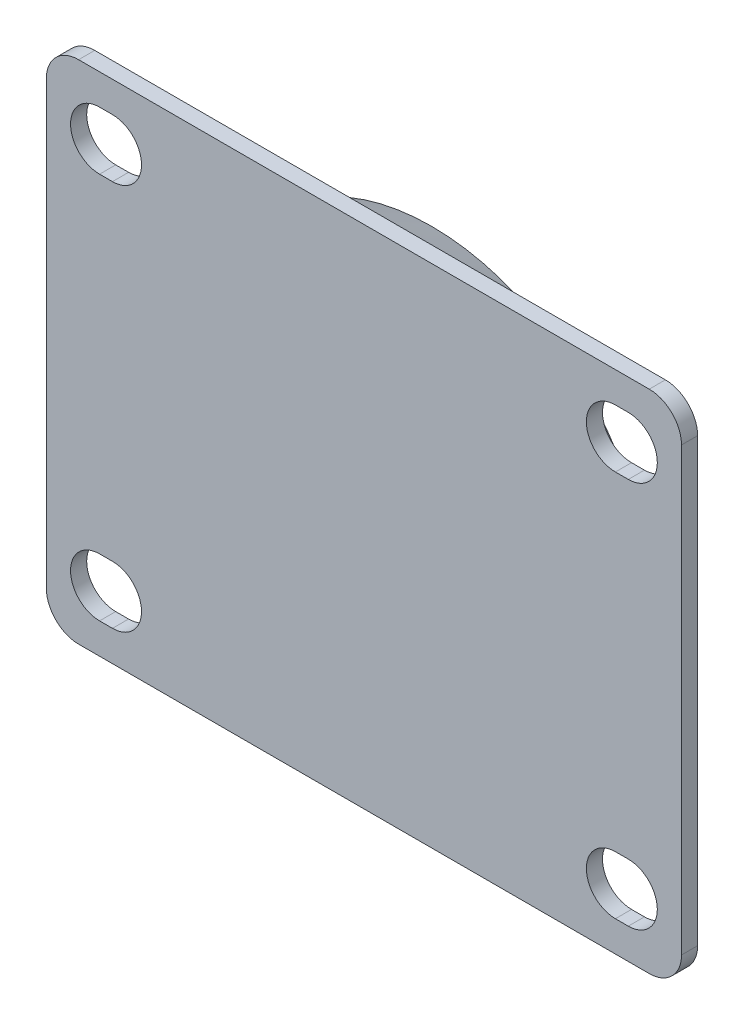
ISO-10303-21;
HEADER;
FILE_DESCRIPTION(('STEP AP214'),'2;1');
FILE_NAME('part.step','',(''),(''),'','','');
FILE_SCHEMA(('AUTOMOTIVE_DESIGN { 1 0 10303 214 1 1 1 1 }'));
ENDSEC;
DATA;
#1=APPLICATION_CONTEXT('core data for automotive mechanical design processes');
#2=APPLICATION_PROTOCOL_DEFINITION('international standard','automotive_design',2000,#1);
#3=PRODUCT_CONTEXT('',#1,'mechanical');
#4=PRODUCT('Part','Part','',(#3));
#5=PRODUCT_RELATED_PRODUCT_CATEGORY('part','',(#4));
#6=PRODUCT_DEFINITION_FORMATION('','',#4);
#7=PRODUCT_DEFINITION_CONTEXT('part definition',#1,'design');
#8=PRODUCT_DEFINITION('design','',#6,#7);
#9=PRODUCT_DEFINITION_SHAPE('','',#8);
#10=(LENGTH_UNIT() NAMED_UNIT(*) SI_UNIT(.MILLI.,.METRE.));
#11=(NAMED_UNIT(*) PLANE_ANGLE_UNIT() SI_UNIT($,.RADIAN.));
#12=(NAMED_UNIT(*) SI_UNIT($,.STERADIAN.) SOLID_ANGLE_UNIT());
#13=UNCERTAINTY_MEASURE_WITH_UNIT(LENGTH_MEASURE(1.E-05),#10,'distance_accuracy_value','');
#14=(GEOMETRIC_REPRESENTATION_CONTEXT(3) GLOBAL_UNCERTAINTY_ASSIGNED_CONTEXT((#13)) GLOBAL_UNIT_ASSIGNED_CONTEXT((#10,
#11,#12)) REPRESENTATION_CONTEXT('',''));
#15=CARTESIAN_POINT('',(0.,0.,0.));
#16=DIRECTION('',(0.,0.,1.));
#17=DIRECTION('',(1.,0.,0.));
#18=AXIS2_PLACEMENT_3D('',#15,#16,#17);
#19=CARTESIAN_POINT('',(-44.25,34.25,0.));
#20=DIRECTION('',(0.,0.,1.));
#21=DIRECTION('',(1.,0.,0.));
#22=AXIS2_PLACEMENT_3D('',#19,#20,#21);
#23=PLANE('',#22);
#24=CARTESIAN_POINT('',(0.,0.,0.));
#25=DIRECTION('',(0.,0.,1.));
#26=DIRECTION('',(1.,0.,0.));
#27=AXIS2_PLACEMENT_3D('',#24,#25,#26);
#28=CIRCLE('',#27,33.75);
#29=CARTESIAN_POINT('',(33.75,0.,0.));
#30=VERTEX_POINT('',#29);
#31=EDGE_CURVE('E290',#30,#30,#28,.F.);
#32=ORIENTED_EDGE('',*,*,#31,.T.);
#33=EDGE_LOOP('',(#32));
#34=FACE_BOUND('',#33,.T.);
#35=ADVANCED_FACE('F17',(#34),#23,.F.);
#36=CARTESIAN_POINT('',(0.,0.,0.));
#37=DIRECTION('',(0.,0.,1.));
#38=DIRECTION('',(1.,0.,0.));
#39=AXIS2_PLACEMENT_3D('',#36,#37,#38);
#40=CYLINDRICAL_SURFACE('',#39,33.75);
#41=CARTESIAN_POINT('',(0.,0.,-8.00000000000001));
#42=DIRECTION('',(0.,0.,1.));
#43=DIRECTION('',(1.,0.,0.));
#44=AXIS2_PLACEMENT_3D('',#41,#42,#43);
#45=CIRCLE('',#44,33.75);
#46=CARTESIAN_POINT('',(33.75,0.,-8.));
#47=VERTEX_POINT('',#46);
#48=EDGE_CURVE('E292',#47,#47,#45,.T.);
#49=ORIENTED_EDGE('',*,*,#48,.F.);
#50=EDGE_LOOP('',(#49));
#51=FACE_BOUND('',#50,.T.);
#52=ORIENTED_EDGE('',*,*,#31,.F.);
#53=EDGE_LOOP('',(#52));
#54=FACE_BOUND('',#53,.T.);
#55=ADVANCED_FACE('F701',(#51,#54),#40,.F.);
#56=CARTESIAN_POINT('',(0.,0.,-1.10557280900008));
#57=DIRECTION('',(0.,0.,1.));
#58=DIRECTION('',(1.,0.,0.));
#59=AXIS2_PLACEMENT_3D('',#56,#57,#58);
#60=CONICAL_SURFACE('',#59,37.1972135955,0.463647609000806);
#61=CARTESIAN_POINT('',(0.,0.,-1.10557280900009));
#62=DIRECTION('',(0.,0.,1.));
#63=DIRECTION('',(1.,0.,0.));
#64=AXIS2_PLACEMENT_3D('',#61,#62,#63);
#65=CIRCLE('',#64,37.1972135955);
#66=CARTESIAN_POINT('',(37.1972135955,0.,-1.10557280900009));
#67=VERTEX_POINT('',#66);
#68=EDGE_CURVE('E203',#67,#67,#65,.F.);
#69=ORIENTED_EDGE('',*,*,#68,.T.);
#70=EDGE_LOOP('',(#69));
#71=FACE_BOUND('',#70,.T.);
#72=ORIENTED_EDGE('',*,*,#48,.T.);
#73=EDGE_LOOP('',(#72));
#74=FACE_BOUND('',#73,.T.);
#75=ADVANCED_FACE('F694',(#71,#74),#60,.T.);
#76=CARTESIAN_POINT('',(0.,0.,-2.));
#77=DIRECTION('',(0.,0.,1.));
#78=DIRECTION('',(1.,0.,0.));
#79=AXIS2_PLACEMENT_3D('',#76,#77,#78);
#80=TOROIDAL_SURFACE('',#79,38.9860679774998,2.);
#81=CARTESIAN_POINT('',(0.,0.,0.));
#82=DIRECTION('',(0.,0.,-1.));
#83=DIRECTION('',(-1.,0.,0.));
#84=AXIS2_PLACEMENT_3D('',#81,#82,#83);
#85=CIRCLE('',#84,38.9860679774998);
#86=CARTESIAN_POINT('',(-38.9860679774998,0.,0.));
#87=VERTEX_POINT('',#86);
#88=CARTESIAN_POINT('',(38.9860679774998,0.,0.));
#89=VERTEX_POINT('',#88);
#90=EDGE_CURVE('E193',#87,#89,#85,.T.);
#91=ORIENTED_EDGE('',*,*,#90,.T.);
#92=CARTESIAN_POINT('',(0.,0.,0.));
#93=DIRECTION('',(0.,0.,-1.));
#94=DIRECTION('',(1.,0.,0.));
#95=AXIS2_PLACEMENT_3D('',#92,#93,#94);
#96=CIRCLE('',#95,38.9860679774998);
#97=EDGE_CURVE('E191',#89,#87,#96,.T.);
#98=ORIENTED_EDGE('',*,*,#97,.T.);
#99=EDGE_LOOP('',(#91,#98));
#100=FACE_BOUND('',#99,.T.);
#101=ORIENTED_EDGE('',*,*,#68,.F.);
#102=EDGE_LOOP('',(#101));
#103=FACE_BOUND('',#102,.T.);
#104=ADVANCED_FACE('F195',(#100,#103),#80,.F.);
#105=CARTESIAN_POINT('',(-44.25,34.25,0.));
#106=DIRECTION('',(0.,0.,1.));
#107=DIRECTION('',(1.,0.,0.));
#108=AXIS2_PLACEMENT_3D('',#105,#106,#107);
#109=PLANE('',#108);
#110=DIRECTION('',(1.,0.,0.));
#111=VECTOR('',#110,1.);
#112=CARTESIAN_POINT('',(41.,-25.5,0.));
#113=LINE('',#112,#111);
#114=CARTESIAN_POINT('',(39.,-25.5,0.));
#115=VERTEX_POINT('',#114);
#116=CARTESIAN_POINT('',(41.,-25.5,0.));
#117=VERTEX_POINT('',#116);
#118=EDGE_CURVE('E184',#115,#117,#113,.T.);
#119=ORIENTED_EDGE('',*,*,#118,.F.);
#120=CARTESIAN_POINT('',(39.,-30.,0.));
#121=DIRECTION('',(0.,0.,-1.));
#122=DIRECTION('',(-1.,0.,0.));
#123=AXIS2_PLACEMENT_3D('',#120,#121,#122);
#124=CIRCLE('',#123,4.5);
#125=CARTESIAN_POINT('',(39.,-34.5,0.));
#126=VERTEX_POINT('',#125);
#127=EDGE_CURVE('E272',#115,#126,#124,.F.);
#128=ORIENTED_EDGE('',*,*,#127,.T.);
#129=DIRECTION('',(-1.,0.,0.));
#130=VECTOR('',#129,1.);
#131=CARTESIAN_POINT('',(39.,-34.5,0.));
#132=LINE('',#131,#130);
#133=CARTESIAN_POINT('',(41.,-34.5,0.));
#134=VERTEX_POINT('',#133);
#135=EDGE_CURVE('E178',#134,#126,#132,.T.);
#136=ORIENTED_EDGE('',*,*,#135,.F.);
#137=CARTESIAN_POINT('',(41.,-30.,0.));
#138=DIRECTION('',(0.,0.,-1.));
#139=DIRECTION('',(-1.,0.,0.));
#140=AXIS2_PLACEMENT_3D('',#137,#138,#139);
#141=CIRCLE('',#140,4.5);
#142=EDGE_CURVE('E279',#134,#117,#141,.F.);
#143=ORIENTED_EDGE('',*,*,#142,.T.);
#144=EDGE_LOOP('',(#119,#128,#136,#143));
#145=FACE_BOUND('',#144,.T.);
#146=CARTESIAN_POINT('',(-41.,30.,0.));
#147=DIRECTION('',(0.,0.,-1.));
#148=DIRECTION('',(-1.,0.,0.));
#149=AXIS2_PLACEMENT_3D('',#146,#147,#148);
#150=CIRCLE('',#149,4.5);
#151=CARTESIAN_POINT('',(-41.,34.5,0.));
#152=VERTEX_POINT('',#151);
#153=CARTESIAN_POINT('',(-41.,25.5,0.));
#154=VERTEX_POINT('',#153);
#155=EDGE_CURVE('E276',#152,#154,#150,.F.);
#156=ORIENTED_EDGE('',*,*,#155,.T.);
#157=DIRECTION('',(-1.,0.,0.));
#158=VECTOR('',#157,1.);
#159=CARTESIAN_POINT('',(-41.,25.5,0.));
#160=LINE('',#159,#158);
#161=CARTESIAN_POINT('',(-39.,25.5,0.));
#162=VERTEX_POINT('',#161);
#163=EDGE_CURVE('E268',#162,#154,#160,.T.);
#164=ORIENTED_EDGE('',*,*,#163,.F.);
#165=CARTESIAN_POINT('',(-39.,30.,0.));
#166=DIRECTION('',(0.,0.,-1.));
#167=DIRECTION('',(-1.,0.,0.));
#168=AXIS2_PLACEMENT_3D('',#165,#166,#167);
#169=CIRCLE('',#168,4.5);
#170=CARTESIAN_POINT('',(-39.,34.5,0.));
#171=VERTEX_POINT('',#170);
#172=EDGE_CURVE('E360',#162,#171,#169,.F.);
#173=ORIENTED_EDGE('',*,*,#172,.T.);
#174=DIRECTION('',(1.,0.,0.));
#175=VECTOR('',#174,1.);
#176=CARTESIAN_POINT('',(-39.,34.5,0.));
#177=LINE('',#176,#175);
#178=EDGE_CURVE('E273',#152,#171,#177,.T.);
#179=ORIENTED_EDGE('',*,*,#178,.F.);
#180=EDGE_LOOP('',(#156,#164,#173,#179));
#181=FACE_BOUND('',#180,.T.);
#182=DIRECTION('',(1.,0.,0.));
#183=VECTOR('',#182,1.);
#184=CARTESIAN_POINT('',(-44.25,39.25,0.));
#185=LINE('',#184,#183);
#186=CARTESIAN_POINT('',(-44.25,39.25,0.));
#187=VERTEX_POINT('',#186);
#188=CARTESIAN_POINT('',(44.25,39.25,0.));
#189=VERTEX_POINT('',#188);
#190=EDGE_CURVE('E245',#187,#189,#185,.T.);
#191=ORIENTED_EDGE('',*,*,#190,.T.);
#192=CARTESIAN_POINT('',(44.25,34.25,0.));
#193=DIRECTION('',(0.,0.,-1.));
#194=DIRECTION('',(-1.,0.,0.));
#195=AXIS2_PLACEMENT_3D('',#192,#193,#194);
#196=CIRCLE('',#195,5.);
#197=CARTESIAN_POINT('',(49.25,34.25,0.));
#198=VERTEX_POINT('',#197);
#199=EDGE_CURVE('E256',#198,#189,#196,.F.);
#200=ORIENTED_EDGE('',*,*,#199,.F.);
#201=DIRECTION('',(0.,-1.,0.));
#202=VECTOR('',#201,1.);
#203=CARTESIAN_POINT('',(49.25,-34.25,0.));
#204=LINE('',#203,#202);
#205=CARTESIAN_POINT('',(49.25,-34.25,0.));
#206=VERTEX_POINT('',#205);
#207=EDGE_CURVE('E253',#198,#206,#204,.T.);
#208=ORIENTED_EDGE('',*,*,#207,.T.);
#209=CARTESIAN_POINT('',(44.25,-34.25,0.));
#210=DIRECTION('',(0.,0.,-1.));
#211=DIRECTION('',(-1.,0.,0.));
#212=AXIS2_PLACEMENT_3D('',#209,#210,#211);
#213=CIRCLE('',#212,5.);
#214=CARTESIAN_POINT('',(44.25,-39.25,0.));
#215=VERTEX_POINT('',#214);
#216=EDGE_CURVE('E261',#215,#206,#213,.F.);
#217=ORIENTED_EDGE('',*,*,#216,.F.);
#218=DIRECTION('',(1.,0.,0.));
#219=VECTOR('',#218,1.);
#220=CARTESIAN_POINT('',(-44.25,-39.25,0.));
#221=LINE('',#220,#219);
#222=CARTESIAN_POINT('',(-44.25,-39.25,0.));
#223=VERTEX_POINT('',#222);
#224=EDGE_CURVE('E258',#215,#223,#221,.F.);
#225=ORIENTED_EDGE('',*,*,#224,.T.);
#226=CARTESIAN_POINT('',(-44.25,-34.25,0.));
#227=DIRECTION('',(0.,0.,-1.));
#228=DIRECTION('',(-1.,0.,0.));
#229=AXIS2_PLACEMENT_3D('',#226,#227,#228);
#230=CIRCLE('',#229,5.);
#231=CARTESIAN_POINT('',(-49.25,-34.25,0.));
#232=VERTEX_POINT('',#231);
#233=EDGE_CURVE('E266',#232,#223,#230,.F.);
#234=ORIENTED_EDGE('',*,*,#233,.F.);
#235=DIRECTION('',(0.,1.,0.));
#236=VECTOR('',#235,1.);
#237=CARTESIAN_POINT('',(-49.25,-34.25,0.));
#238=LINE('',#237,#236);
#239=CARTESIAN_POINT('',(-49.25,34.25,0.));
#240=VERTEX_POINT('',#239);
#241=EDGE_CURVE('E263',#232,#240,#238,.T.);
#242=ORIENTED_EDGE('',*,*,#241,.T.);
#243=CARTESIAN_POINT('',(-44.25,34.25,0.));
#244=DIRECTION('',(0.,0.,-1.));
#245=DIRECTION('',(-1.,0.,0.));
#246=AXIS2_PLACEMENT_3D('',#243,#244,#245);
#247=CIRCLE('',#246,5.);
#248=EDGE_CURVE('E358',#187,#240,#247,.F.);
#249=ORIENTED_EDGE('',*,*,#248,.F.);
#250=EDGE_LOOP('',(#191,#200,#208,#217,#225,#234,#242,#249));
#251=FACE_BOUND('',#250,.T.);
#252=CARTESIAN_POINT('',(39.,30.,0.));
#253=DIRECTION('',(0.,0.,-1.));
#254=DIRECTION('',(-1.,0.,0.));
#255=AXIS2_PLACEMENT_3D('',#252,#253,#254);
#256=CIRCLE('',#255,4.5);
#257=CARTESIAN_POINT('',(39.,34.5,0.));
#258=VERTEX_POINT('',#257);
#259=CARTESIAN_POINT('',(39.,25.5,0.));
#260=VERTEX_POINT('',#259);
#261=EDGE_CURVE('E249',#258,#260,#256,.F.);
#262=ORIENTED_EDGE('',*,*,#261,.T.);
#263=DIRECTION('',(-1.,0.,0.));
#264=VECTOR('',#263,1.);
#265=CARTESIAN_POINT('',(41.,25.5,0.));
#266=LINE('',#265,#264);
#267=CARTESIAN_POINT('',(41.,25.5,0.));
#268=VERTEX_POINT('',#267);
#269=EDGE_CURVE('E241',#268,#260,#266,.T.);
#270=ORIENTED_EDGE('',*,*,#269,.F.);
#271=CARTESIAN_POINT('',(41.,30.,0.));
#272=DIRECTION('',(0.,0.,-1.));
#273=DIRECTION('',(-1.,0.,0.));
#274=AXIS2_PLACEMENT_3D('',#271,#272,#273);
#275=CIRCLE('',#274,4.5);
#276=CARTESIAN_POINT('',(41.,34.5,0.));
#277=VERTEX_POINT('',#276);
#278=EDGE_CURVE('E236',#268,#277,#275,.F.);
#279=ORIENTED_EDGE('',*,*,#278,.T.);
#280=DIRECTION('',(1.,0.,0.));
#281=VECTOR('',#280,1.);
#282=CARTESIAN_POINT('',(39.,34.5,0.));
#283=LINE('',#282,#281);
#284=EDGE_CURVE('E246',#258,#277,#283,.T.);
#285=ORIENTED_EDGE('',*,*,#284,.F.);
#286=EDGE_LOOP('',(#262,#270,#279,#285));
#287=FACE_BOUND('',#286,.T.);
#288=DIRECTION('',(1.,0.,0.));
#289=VECTOR('',#288,1.);
#290=CARTESIAN_POINT('',(-41.,-25.5,0.));
#291=LINE('',#290,#289);
#292=CARTESIAN_POINT('',(-41.,-25.5,0.));
#293=VERTEX_POINT('',#292);
#294=CARTESIAN_POINT('',(-39.,-25.5,0.));
#295=VERTEX_POINT('',#294);
#296=EDGE_CURVE('E228',#293,#295,#291,.T.);
#297=ORIENTED_EDGE('',*,*,#296,.F.);
#298=CARTESIAN_POINT('',(-41.,-30.,0.));
#299=DIRECTION('',(0.,0.,-1.));
#300=DIRECTION('',(-1.,0.,0.));
#301=AXIS2_PLACEMENT_3D('',#298,#299,#300);
#302=CIRCLE('',#301,4.5);
#303=CARTESIAN_POINT('',(-41.,-34.5,0.));
#304=VERTEX_POINT('',#303);
#305=EDGE_CURVE('E343',#293,#304,#302,.F.);
#306=ORIENTED_EDGE('',*,*,#305,.T.);
#307=DIRECTION('',(-1.,0.,0.));
#308=VECTOR('',#307,1.);
#309=CARTESIAN_POINT('',(-39.,-34.5,0.));
#310=LINE('',#309,#308);
#311=CARTESIAN_POINT('',(-39.,-34.5,0.));
#312=VERTEX_POINT('',#311);
#313=EDGE_CURVE('E237',#312,#304,#310,.T.);
#314=ORIENTED_EDGE('',*,*,#313,.F.);
#315=CARTESIAN_POINT('',(-39.,-30.,0.));
#316=DIRECTION('',(0.,0.,-1.));
#317=DIRECTION('',(-1.,0.,0.));
#318=AXIS2_PLACEMENT_3D('',#315,#316,#317);
#319=CIRCLE('',#318,4.5);
#320=EDGE_CURVE('E240',#312,#295,#319,.F.);
#321=ORIENTED_EDGE('',*,*,#320,.T.);
#322=EDGE_LOOP('',(#297,#306,#314,#321));
#323=FACE_BOUND('',#322,.T.);
#324=ORIENTED_EDGE('',*,*,#97,.F.);
#325=ORIENTED_EDGE('',*,*,#90,.F.);
#326=EDGE_LOOP('',(#324,#325));
#327=FACE_BOUND('',#326,.T.);
#328=ADVANCED_FACE('F202',(#145,#181,#251,#287,#323,#327),#109,.F.);
#329=CARTESIAN_POINT('',(41.,-25.5,2.5));
#330=DIRECTION('',(0.,-1.,0.));
#331=DIRECTION('',(1.,0.,0.));
#332=AXIS2_PLACEMENT_3D('',#329,#330,#331);
#333=PLANE('',#332);
#334=DIRECTION('',(1.,0.,0.));
#335=VECTOR('',#334,1.);
#336=CARTESIAN_POINT('',(-44.25,-25.5,2.5));
#337=LINE('',#336,#335);
#338=CARTESIAN_POINT('',(39.,-25.5,2.5));
#339=VERTEX_POINT('',#338);
#340=CARTESIAN_POINT('',(41.,-25.5,2.5));
#341=VERTEX_POINT('',#340);
#342=EDGE_CURVE('E342',#339,#341,#337,.T.);
#343=ORIENTED_EDGE('',*,*,#342,.F.);
#344=DIRECTION('',(0.,0.,-1.));
#345=VECTOR('',#344,1.);
#346=CARTESIAN_POINT('',(39.,-25.5,2.5));
#347=LINE('',#346,#345);
#348=EDGE_CURVE('E372',#339,#115,#347,.T.);
#349=ORIENTED_EDGE('',*,*,#348,.T.);
#350=ORIENTED_EDGE('',*,*,#118,.T.);
#351=DIRECTION('',(0.,0.,-1.));
#352=VECTOR('',#351,1.);
#353=CARTESIAN_POINT('',(41.,-25.5,2.5));
#354=LINE('',#353,#352);
#355=EDGE_CURVE('E206',#117,#341,#354,.F.);
#356=ORIENTED_EDGE('',*,*,#355,.T.);
#357=EDGE_LOOP('',(#343,#349,#350,#356));
#358=FACE_BOUND('',#357,.T.);
#359=ADVANCED_FACE('F220',(#358),#333,.T.);
#360=CARTESIAN_POINT('',(41.,-30.,2.5));
#361=DIRECTION('',(0.,0.,-1.));
#362=DIRECTION('',(-1.,0.,0.));
#363=AXIS2_PLACEMENT_3D('',#360,#361,#362);
#364=CYLINDRICAL_SURFACE('',#363,4.5);
#365=DIRECTION('',(0.,0.,1.));
#366=VECTOR('',#365,1.);
#367=CARTESIAN_POINT('',(41.,-34.5,2.5));
#368=LINE('',#367,#366);
#369=CARTESIAN_POINT('',(41.,-34.5,2.5));
#370=VERTEX_POINT('',#369);
#371=EDGE_CURVE('E278',#370,#134,#368,.F.);
#372=ORIENTED_EDGE('',*,*,#371,.F.);
#373=CARTESIAN_POINT('',(41.,-30.,2.5));
#374=DIRECTION('',(0.,0.,-1.));
#375=DIRECTION('',(-1.,0.,0.));
#376=AXIS2_PLACEMENT_3D('',#373,#374,#375);
#377=CIRCLE('',#376,4.5);
#378=EDGE_CURVE('E339',#341,#370,#377,.T.);
#379=ORIENTED_EDGE('',*,*,#378,.F.);
#380=ORIENTED_EDGE('',*,*,#355,.F.);
#381=ORIENTED_EDGE('',*,*,#142,.F.);
#382=EDGE_LOOP('',(#372,#379,#380,#381));
#383=FACE_BOUND('',#382,.T.);
#384=ADVANCED_FACE('F667',(#383),#364,.F.);
#385=CARTESIAN_POINT('',(39.,-34.5,2.5));
#386=DIRECTION('',(0.,1.,0.));
#387=DIRECTION('',(-1.,0.,0.));
#388=AXIS2_PLACEMENT_3D('',#385,#386,#387);
#389=PLANE('',#388);
#390=DIRECTION('',(1.,0.,0.));
#391=VECTOR('',#390,1.);
#392=CARTESIAN_POINT('',(-44.25,-34.5,2.5));
#393=LINE('',#392,#391);
#394=CARTESIAN_POINT('',(39.,-34.5,2.5));
#395=VERTEX_POINT('',#394);
#396=EDGE_CURVE('E338',#370,#395,#393,.F.);
#397=ORIENTED_EDGE('',*,*,#396,.F.);
#398=ORIENTED_EDGE('',*,*,#371,.T.);
#399=ORIENTED_EDGE('',*,*,#135,.T.);
#400=DIRECTION('',(0.,0.,-1.));
#401=VECTOR('',#400,1.);
#402=CARTESIAN_POINT('',(39.,-34.5,2.5));
#403=LINE('',#402,#401);
#404=EDGE_CURVE('E284',#126,#395,#403,.F.);
#405=ORIENTED_EDGE('',*,*,#404,.T.);
#406=EDGE_LOOP('',(#397,#398,#399,#405));
#407=FACE_BOUND('',#406,.T.);
#408=ADVANCED_FACE('F376',(#407),#389,.T.);
#409=CARTESIAN_POINT('',(39.,-30.,2.5));
#410=DIRECTION('',(0.,0.,-1.));
#411=DIRECTION('',(-1.,0.,0.));
#412=AXIS2_PLACEMENT_3D('',#409,#410,#411);
#413=CYLINDRICAL_SURFACE('',#412,4.5);
#414=ORIENTED_EDGE('',*,*,#348,.F.);
#415=CARTESIAN_POINT('',(39.,-30.,2.5));
#416=DIRECTION('',(0.,0.,-1.));
#417=DIRECTION('',(-1.,0.,0.));
#418=AXIS2_PLACEMENT_3D('',#415,#416,#417);
#419=CIRCLE('',#418,4.5);
#420=EDGE_CURVE('E336',#395,#339,#419,.T.);
#421=ORIENTED_EDGE('',*,*,#420,.F.);
#422=ORIENTED_EDGE('',*,*,#404,.F.);
#423=ORIENTED_EDGE('',*,*,#127,.F.);
#424=EDGE_LOOP('',(#414,#421,#422,#423));
#425=FACE_BOUND('',#424,.T.);
#426=ADVANCED_FACE('F381',(#425),#413,.F.);
#427=CARTESIAN_POINT('',(-41.,25.5,2.5));
#428=DIRECTION('',(0.,1.,0.));
#429=DIRECTION('',(-1.,0.,0.));
#430=AXIS2_PLACEMENT_3D('',#427,#428,#429);
#431=PLANE('',#430);
#432=DIRECTION('',(1.,0.,0.));
#433=VECTOR('',#432,1.);
#434=CARTESIAN_POINT('',(-44.25,25.5,2.5));
#435=LINE('',#434,#433);
#436=CARTESIAN_POINT('',(-39.,25.5,2.5));
#437=VERTEX_POINT('',#436);
#438=CARTESIAN_POINT('',(-41.,25.5,2.5));
#439=VERTEX_POINT('',#438);
#440=EDGE_CURVE('E335',#437,#439,#435,.F.);
#441=ORIENTED_EDGE('',*,*,#440,.F.);
#442=DIRECTION('',(0.,0.,-1.));
#443=VECTOR('',#442,1.);
#444=CARTESIAN_POINT('',(-39.,25.5,2.5));
#445=LINE('',#444,#443);
#446=EDGE_CURVE('E362',#437,#162,#445,.T.);
#447=ORIENTED_EDGE('',*,*,#446,.T.);
#448=ORIENTED_EDGE('',*,*,#163,.T.);
#449=DIRECTION('',(0.,0.,-1.));
#450=VECTOR('',#449,1.);
#451=CARTESIAN_POINT('',(-41.,25.5,2.5));
#452=LINE('',#451,#450);
#453=EDGE_CURVE('E271',#154,#439,#452,.F.);
#454=ORIENTED_EDGE('',*,*,#453,.T.);
#455=EDGE_LOOP('',(#441,#447,#448,#454));
#456=FACE_BOUND('',#455,.T.);
#457=ADVANCED_FACE('F422',(#456),#431,.T.);
#458=CARTESIAN_POINT('',(-41.,30.,2.5));
#459=DIRECTION('',(0.,0.,-1.));
#460=DIRECTION('',(-1.,0.,0.));
#461=AXIS2_PLACEMENT_3D('',#458,#459,#460);
#462=CYLINDRICAL_SURFACE('',#461,4.5);
#463=DIRECTION('',(0.,0.,1.));
#464=VECTOR('',#463,1.);
#465=CARTESIAN_POINT('',(-41.,34.5,2.5));
#466=LINE('',#465,#464);
#467=CARTESIAN_POINT('',(-41.,34.5,2.5));
#468=VERTEX_POINT('',#467);
#469=EDGE_CURVE('E275',#468,#152,#466,.F.);
#470=ORIENTED_EDGE('',*,*,#469,.F.);
#471=CARTESIAN_POINT('',(-41.,30.,2.5));
#472=DIRECTION('',(0.,0.,-1.));
#473=DIRECTION('',(-1.,0.,0.));
#474=AXIS2_PLACEMENT_3D('',#471,#472,#473);
#475=CIRCLE('',#474,4.5);
#476=EDGE_CURVE('E333',#439,#468,#475,.T.);
#477=ORIENTED_EDGE('',*,*,#476,.F.);
#478=ORIENTED_EDGE('',*,*,#453,.F.);
#479=ORIENTED_EDGE('',*,*,#155,.F.);
#480=EDGE_LOOP('',(#470,#477,#478,#479));
#481=FACE_BOUND('',#480,.T.);
#482=ADVANCED_FACE('F433',(#481),#462,.F.);
#483=CARTESIAN_POINT('',(-39.,34.5,2.5));
#484=DIRECTION('',(0.,-1.,0.));
#485=DIRECTION('',(1.,0.,0.));
#486=AXIS2_PLACEMENT_3D('',#483,#484,#485);
#487=PLANE('',#486);
#488=DIRECTION('',(1.,0.,0.));
#489=VECTOR('',#488,1.);
#490=CARTESIAN_POINT('',(-44.25,34.5,2.5));
#491=LINE('',#490,#489);
#492=CARTESIAN_POINT('',(-39.,34.5,2.5));
#493=VERTEX_POINT('',#492);
#494=EDGE_CURVE('E332',#468,#493,#491,.T.);
#495=ORIENTED_EDGE('',*,*,#494,.F.);
#496=ORIENTED_EDGE('',*,*,#469,.T.);
#497=ORIENTED_EDGE('',*,*,#178,.T.);
#498=DIRECTION('',(0.,0.,-1.));
#499=VECTOR('',#498,1.);
#500=CARTESIAN_POINT('',(-39.,34.5,2.5));
#501=LINE('',#500,#499);
#502=EDGE_CURVE('E418',#171,#493,#501,.F.);
#503=ORIENTED_EDGE('',*,*,#502,.T.);
#504=EDGE_LOOP('',(#495,#496,#497,#503));
#505=FACE_BOUND('',#504,.T.);
#506=ADVANCED_FACE('F435',(#505),#487,.T.);
#507=CARTESIAN_POINT('',(-39.,30.,2.5));
#508=DIRECTION('',(0.,0.,-1.));
#509=DIRECTION('',(-1.,0.,0.));
#510=AXIS2_PLACEMENT_3D('',#507,#508,#509);
#511=CYLINDRICAL_SURFACE('',#510,4.5);
#512=ORIENTED_EDGE('',*,*,#446,.F.);
#513=CARTESIAN_POINT('',(-39.,30.,2.5));
#514=DIRECTION('',(0.,0.,-1.));
#515=DIRECTION('',(-1.,0.,0.));
#516=AXIS2_PLACEMENT_3D('',#513,#514,#515);
#517=CIRCLE('',#516,4.5);
#518=EDGE_CURVE('E329',#493,#437,#517,.T.);
#519=ORIENTED_EDGE('',*,*,#518,.F.);
#520=ORIENTED_EDGE('',*,*,#502,.F.);
#521=ORIENTED_EDGE('',*,*,#172,.F.);
#522=EDGE_LOOP('',(#512,#519,#520,#521));
#523=FACE_BOUND('',#522,.T.);
#524=ADVANCED_FACE('F427',(#523),#511,.F.);
#525=CARTESIAN_POINT('',(-44.25,34.25,2.5));
#526=DIRECTION('',(0.,0.,-1.));
#527=DIRECTION('',(-1.,0.,0.));
#528=AXIS2_PLACEMENT_3D('',#525,#526,#527);
#529=CYLINDRICAL_SURFACE('',#528,5.);
#530=CARTESIAN_POINT('',(-44.25,34.25,2.5));
#531=DIRECTION('',(0.,0.,-1.));
#532=DIRECTION('',(-1.,0.,0.));
#533=AXIS2_PLACEMENT_3D('',#530,#531,#532);
#534=CIRCLE('',#533,5.);
#535=CARTESIAN_POINT('',(-44.25,39.25,2.5));
#536=VERTEX_POINT('',#535);
#537=CARTESIAN_POINT('',(-49.25,34.25,2.5));
#538=VERTEX_POINT('',#537);
#539=EDGE_CURVE('E326',#536,#538,#534,.F.);
#540=ORIENTED_EDGE('',*,*,#539,.F.);
#541=DIRECTION('',(0.,0.,-1.));
#542=VECTOR('',#541,1.);
#543=CARTESIAN_POINT('',(-44.25,39.25,2.5));
#544=LINE('',#543,#542);
#545=EDGE_CURVE('E252',#536,#187,#544,.T.);
#546=ORIENTED_EDGE('',*,*,#545,.T.);
#547=ORIENTED_EDGE('',*,*,#248,.T.);
#548=DIRECTION('',(0.,0.,1.));
#549=VECTOR('',#548,1.);
#550=CARTESIAN_POINT('',(-49.25,34.25,2.5));
#551=LINE('',#550,#549);
#552=EDGE_CURVE('E267',#240,#538,#551,.T.);
#553=ORIENTED_EDGE('',*,*,#552,.T.);
#554=EDGE_LOOP('',(#540,#546,#547,#553));
#555=FACE_BOUND('',#554,.T.);
#556=ADVANCED_FACE('F615',(#555),#529,.T.);
#557=CARTESIAN_POINT('',(-49.25,-34.25,2.5));
#558=DIRECTION('',(1.,0.,0.));
#559=DIRECTION('',(0.,1.,0.));
#560=AXIS2_PLACEMENT_3D('',#557,#558,#559);
#561=PLANE('',#560);
#562=DIRECTION('',(0.,0.,-1.));
#563=VECTOR('',#562,1.);
#564=CARTESIAN_POINT('',(-49.25,-34.25,2.5));
#565=LINE('',#564,#563);
#566=CARTESIAN_POINT('',(-49.25,-34.25,2.5));
#567=VERTEX_POINT('',#566);
#568=EDGE_CURVE('E357',#567,#232,#565,.T.);
#569=ORIENTED_EDGE('',*,*,#568,.F.);
#570=DIRECTION('',(0.,1.,0.));
#571=VECTOR('',#570,1.);
#572=CARTESIAN_POINT('',(-49.25,34.25,2.5));
#573=LINE('',#572,#571);
#574=EDGE_CURVE('E325',#538,#567,#573,.F.);
#575=ORIENTED_EDGE('',*,*,#574,.F.);
#576=ORIENTED_EDGE('',*,*,#552,.F.);
#577=ORIENTED_EDGE('',*,*,#241,.F.);
#578=EDGE_LOOP('',(#569,#575,#576,#577));
#579=FACE_BOUND('',#578,.T.);
#580=ADVANCED_FACE('F606',(#579),#561,.F.);
#581=CARTESIAN_POINT('',(-44.25,-34.25,2.5));
#582=DIRECTION('',(0.,0.,-1.));
#583=DIRECTION('',(-1.,0.,0.));
#584=AXIS2_PLACEMENT_3D('',#581,#582,#583);
#585=CYLINDRICAL_SURFACE('',#584,5.);
#586=CARTESIAN_POINT('',(-44.25,-34.25,2.5));
#587=DIRECTION('',(0.,0.,-1.));
#588=DIRECTION('',(-1.,0.,0.));
#589=AXIS2_PLACEMENT_3D('',#586,#587,#588);
#590=CIRCLE('',#589,5.);
#591=CARTESIAN_POINT('',(-44.25,-39.25,2.5));
#592=VERTEX_POINT('',#591);
#593=EDGE_CURVE('E322',#567,#592,#590,.F.);
#594=ORIENTED_EDGE('',*,*,#593,.F.);
#595=ORIENTED_EDGE('',*,*,#568,.T.);
#596=ORIENTED_EDGE('',*,*,#233,.T.);
#597=DIRECTION('',(0.,0.,1.));
#598=VECTOR('',#597,1.);
#599=CARTESIAN_POINT('',(-44.25,-39.25,2.5));
#600=LINE('',#599,#598);
#601=EDGE_CURVE('E262',#223,#592,#600,.T.);
#602=ORIENTED_EDGE('',*,*,#601,.T.);
#603=EDGE_LOOP('',(#594,#595,#596,#602));
#604=FACE_BOUND('',#603,.T.);
#605=ADVANCED_FACE('F597',(#604),#585,.T.);
#606=CARTESIAN_POINT('',(-44.25,-39.25,2.5));
#607=DIRECTION('',(0.,1.,0.));
#608=DIRECTION('',(0.,0.,1.));
#609=AXIS2_PLACEMENT_3D('',#606,#607,#608);
#610=PLANE('',#609);
#611=DIRECTION('',(0.,0.,-1.));
#612=VECTOR('',#611,1.);
#613=CARTESIAN_POINT('',(44.25,-39.25,2.5));
#614=LINE('',#613,#612);
#615=CARTESIAN_POINT('',(44.25,-39.25,2.5));
#616=VERTEX_POINT('',#615);
#617=EDGE_CURVE('E355',#616,#215,#614,.T.);
#618=ORIENTED_EDGE('',*,*,#617,.F.);
#619=DIRECTION('',(1.,0.,0.));
#620=VECTOR('',#619,1.);
#621=CARTESIAN_POINT('',(-44.25,-39.25,2.5));
#622=LINE('',#621,#620);
#623=EDGE_CURVE('E321',#592,#616,#622,.T.);
#624=ORIENTED_EDGE('',*,*,#623,.F.);
#625=ORIENTED_EDGE('',*,*,#601,.F.);
#626=ORIENTED_EDGE('',*,*,#224,.F.);
#627=EDGE_LOOP('',(#618,#624,#625,#626));
#628=FACE_BOUND('',#627,.T.);
#629=ADVANCED_FACE('F588',(#628),#610,.F.);
#630=CARTESIAN_POINT('',(44.25,-34.25,2.5));
#631=DIRECTION('',(0.,0.,-1.));
#632=DIRECTION('',(-1.,0.,0.));
#633=AXIS2_PLACEMENT_3D('',#630,#631,#632);
#634=CYLINDRICAL_SURFACE('',#633,5.);
#635=CARTESIAN_POINT('',(44.25,-34.25,2.5));
#636=DIRECTION('',(0.,0.,-1.));
#637=DIRECTION('',(-1.,0.,0.));
#638=AXIS2_PLACEMENT_3D('',#635,#636,#637);
#639=CIRCLE('',#638,5.);
#640=CARTESIAN_POINT('',(49.25,-34.25,2.5));
#641=VERTEX_POINT('',#640);
#642=EDGE_CURVE('E318',#616,#641,#639,.F.);
#643=ORIENTED_EDGE('',*,*,#642,.F.);
#644=ORIENTED_EDGE('',*,*,#617,.T.);
#645=ORIENTED_EDGE('',*,*,#216,.T.);
#646=DIRECTION('',(0.,0.,1.));
#647=VECTOR('',#646,1.);
#648=CARTESIAN_POINT('',(49.25,-34.25,2.5));
#649=LINE('',#648,#647);
#650=EDGE_CURVE('E257',#206,#641,#649,.T.);
#651=ORIENTED_EDGE('',*,*,#650,.T.);
#652=EDGE_LOOP('',(#643,#644,#645,#651));
#653=FACE_BOUND('',#652,.T.);
#654=ADVANCED_FACE('F579',(#653),#634,.T.);
#655=CARTESIAN_POINT('',(49.25,-34.25,2.5));
#656=DIRECTION('',(-1.,0.,0.));
#657=DIRECTION('',(0.,-1.,0.));
#658=AXIS2_PLACEMENT_3D('',#655,#656,#657);
#659=PLANE('',#658);
#660=DIRECTION('',(0.,0.,-1.));
#661=VECTOR('',#660,1.);
#662=CARTESIAN_POINT('',(49.25,34.25,2.5));
#663=LINE('',#662,#661);
#664=CARTESIAN_POINT('',(49.25,34.25,2.5));
#665=VERTEX_POINT('',#664);
#666=EDGE_CURVE('E353',#665,#198,#663,.T.);
#667=ORIENTED_EDGE('',*,*,#666,.F.);
#668=DIRECTION('',(0.,1.,0.));
#669=VECTOR('',#668,1.);
#670=CARTESIAN_POINT('',(49.25,34.25,2.5));
#671=LINE('',#670,#669);
#672=EDGE_CURVE('E317',#641,#665,#671,.T.);
#673=ORIENTED_EDGE('',*,*,#672,.F.);
#674=ORIENTED_EDGE('',*,*,#650,.F.);
#675=ORIENTED_EDGE('',*,*,#207,.F.);
#676=EDGE_LOOP('',(#667,#673,#674,#675));
#677=FACE_BOUND('',#676,.T.);
#678=ADVANCED_FACE('F570',(#677),#659,.F.);
#679=CARTESIAN_POINT('',(44.25,34.25,2.5));
#680=DIRECTION('',(0.,0.,-1.));
#681=DIRECTION('',(-1.,0.,0.));
#682=AXIS2_PLACEMENT_3D('',#679,#680,#681);
#683=CYLINDRICAL_SURFACE('',#682,5.);
#684=CARTESIAN_POINT('',(44.25,34.25,2.5));
#685=DIRECTION('',(0.,0.,-1.));
#686=DIRECTION('',(-1.,0.,0.));
#687=AXIS2_PLACEMENT_3D('',#684,#685,#686);
#688=CIRCLE('',#687,5.);
#689=CARTESIAN_POINT('',(44.25,39.25,2.5));
#690=VERTEX_POINT('',#689);
#691=EDGE_CURVE('E313',#665,#690,#688,.F.);
#692=ORIENTED_EDGE('',*,*,#691,.F.);
#693=ORIENTED_EDGE('',*,*,#666,.T.);
#694=ORIENTED_EDGE('',*,*,#199,.T.);
#695=DIRECTION('',(0.,0.,-1.));
#696=VECTOR('',#695,1.);
#697=CARTESIAN_POINT('',(44.25,39.25,2.5));
#698=LINE('',#697,#696);
#699=EDGE_CURVE('E405',#189,#690,#698,.F.);
#700=ORIENTED_EDGE('',*,*,#699,.T.);
#701=EDGE_LOOP('',(#692,#693,#694,#700));
#702=FACE_BOUND('',#701,.T.);
#703=ADVANCED_FACE('F561',(#702),#683,.T.);
#704=CARTESIAN_POINT('',(-44.25,39.25,2.5));
#705=DIRECTION('',(0.,-1.,0.));
#706=DIRECTION('',(0.,0.,-1.));
#707=AXIS2_PLACEMENT_3D('',#704,#705,#706);
#708=PLANE('',#707);
#709=ORIENTED_EDGE('',*,*,#545,.F.);
#710=DIRECTION('',(1.,0.,0.));
#711=VECTOR('',#710,1.);
#712=CARTESIAN_POINT('',(-44.25,39.25,2.5));
#713=LINE('',#712,#711);
#714=EDGE_CURVE('E316',#690,#536,#713,.F.);
#715=ORIENTED_EDGE('',*,*,#714,.F.);
#716=ORIENTED_EDGE('',*,*,#699,.F.);
#717=ORIENTED_EDGE('',*,*,#190,.F.);
#718=EDGE_LOOP('',(#709,#715,#716,#717));
#719=FACE_BOUND('',#718,.T.);
#720=ADVANCED_FACE('F552',(#719),#708,.F.);
#721=CARTESIAN_POINT('',(41.,25.5,2.5));
#722=DIRECTION('',(0.,1.,0.));
#723=DIRECTION('',(-1.,0.,0.));
#724=AXIS2_PLACEMENT_3D('',#721,#722,#723);
#725=PLANE('',#724);
#726=DIRECTION('',(1.,0.,0.));
#727=VECTOR('',#726,1.);
#728=CARTESIAN_POINT('',(-44.25,25.5,2.5));
#729=LINE('',#728,#727);
#730=CARTESIAN_POINT('',(41.,25.5,2.5));
#731=VERTEX_POINT('',#730);
#732=CARTESIAN_POINT('',(39.,25.5,2.5));
#733=VERTEX_POINT('',#732);
#734=EDGE_CURVE('E312',#731,#733,#729,.F.);
#735=ORIENTED_EDGE('',*,*,#734,.F.);
#736=DIRECTION('',(0.,0.,-1.));
#737=VECTOR('',#736,1.);
#738=CARTESIAN_POINT('',(41.,25.5,2.5));
#739=LINE('',#738,#737);
#740=EDGE_CURVE('E350',#731,#268,#739,.T.);
#741=ORIENTED_EDGE('',*,*,#740,.T.);
#742=ORIENTED_EDGE('',*,*,#269,.T.);
#743=DIRECTION('',(0.,0.,-1.));
#744=VECTOR('',#743,1.);
#745=CARTESIAN_POINT('',(39.,25.5,2.5));
#746=LINE('',#745,#744);
#747=EDGE_CURVE('E244',#260,#733,#746,.F.);
#748=ORIENTED_EDGE('',*,*,#747,.T.);
#749=EDGE_LOOP('',(#735,#741,#742,#748));
#750=FACE_BOUND('',#749,.T.);
#751=ADVANCED_FACE('F543',(#750),#725,.T.);
#752=CARTESIAN_POINT('',(39.,30.,2.5));
#753=DIRECTION('',(0.,0.,-1.));
#754=DIRECTION('',(-1.,0.,0.));
#755=AXIS2_PLACEMENT_3D('',#752,#753,#754);
#756=CYLINDRICAL_SURFACE('',#755,4.5);
#757=DIRECTION('',(0.,0.,1.));
#758=VECTOR('',#757,1.);
#759=CARTESIAN_POINT('',(39.,34.5,2.5));
#760=LINE('',#759,#758);
#761=CARTESIAN_POINT('',(39.,34.5,2.5));
#762=VERTEX_POINT('',#761);
#763=EDGE_CURVE('E248',#762,#258,#760,.F.);
#764=ORIENTED_EDGE('',*,*,#763,.F.);
#765=CARTESIAN_POINT('',(39.,30.,2.5));
#766=DIRECTION('',(0.,0.,-1.));
#767=DIRECTION('',(-1.,0.,0.));
#768=AXIS2_PLACEMENT_3D('',#765,#766,#767);
#769=CIRCLE('',#768,4.5);
#770=EDGE_CURVE('E310',#733,#762,#769,.T.);
#771=ORIENTED_EDGE('',*,*,#770,.F.);
#772=ORIENTED_EDGE('',*,*,#747,.F.);
#773=ORIENTED_EDGE('',*,*,#261,.F.);
#774=EDGE_LOOP('',(#764,#771,#772,#773));
#775=FACE_BOUND('',#774,.T.);
#776=ADVANCED_FACE('F534',(#775),#756,.F.);
#777=CARTESIAN_POINT('',(39.,34.5,2.5));
#778=DIRECTION('',(0.,-1.,0.));
#779=DIRECTION('',(1.,0.,0.));
#780=AXIS2_PLACEMENT_3D('',#777,#778,#779);
#781=PLANE('',#780);
#782=DIRECTION('',(1.,0.,0.));
#783=VECTOR('',#782,1.);
#784=CARTESIAN_POINT('',(-44.25,34.5,2.5));
#785=LINE('',#784,#783);
#786=CARTESIAN_POINT('',(41.,34.5,2.5));
#787=VERTEX_POINT('',#786);
#788=EDGE_CURVE('E309',#762,#787,#785,.T.);
#789=ORIENTED_EDGE('',*,*,#788,.F.);
#790=ORIENTED_EDGE('',*,*,#763,.T.);
#791=ORIENTED_EDGE('',*,*,#284,.T.);
#792=DIRECTION('',(0.,0.,-1.));
#793=VECTOR('',#792,1.);
#794=CARTESIAN_POINT('',(41.,34.5,2.5));
#795=LINE('',#794,#793);
#796=EDGE_CURVE('E398',#277,#787,#795,.F.);
#797=ORIENTED_EDGE('',*,*,#796,.T.);
#798=EDGE_LOOP('',(#789,#790,#791,#797));
#799=FACE_BOUND('',#798,.T.);
#800=ADVANCED_FACE('F479',(#799),#781,.T.);
#801=CARTESIAN_POINT('',(41.,30.,2.5));
#802=DIRECTION('',(0.,0.,-1.));
#803=DIRECTION('',(-1.,0.,0.));
#804=AXIS2_PLACEMENT_3D('',#801,#802,#803);
#805=CYLINDRICAL_SURFACE('',#804,4.5);
#806=ORIENTED_EDGE('',*,*,#740,.F.);
#807=CARTESIAN_POINT('',(41.,30.,2.5));
#808=DIRECTION('',(0.,0.,-1.));
#809=DIRECTION('',(-1.,0.,0.));
#810=AXIS2_PLACEMENT_3D('',#807,#808,#809);
#811=CIRCLE('',#810,4.5);
#812=EDGE_CURVE('E306',#787,#731,#811,.T.);
#813=ORIENTED_EDGE('',*,*,#812,.F.);
#814=ORIENTED_EDGE('',*,*,#796,.F.);
#815=ORIENTED_EDGE('',*,*,#278,.F.);
#816=EDGE_LOOP('',(#806,#813,#814,#815));
#817=FACE_BOUND('',#816,.T.);
#818=ADVANCED_FACE('F471',(#817),#805,.F.);
#819=CARTESIAN_POINT('',(-41.,-25.5,2.5));
#820=DIRECTION('',(0.,-1.,0.));
#821=DIRECTION('',(1.,0.,0.));
#822=AXIS2_PLACEMENT_3D('',#819,#820,#821);
#823=PLANE('',#822);
#824=DIRECTION('',(1.,0.,0.));
#825=VECTOR('',#824,1.);
#826=CARTESIAN_POINT('',(-44.25,-25.5,2.5));
#827=LINE('',#826,#825);
#828=CARTESIAN_POINT('',(-41.,-25.5,2.5));
#829=VERTEX_POINT('',#828);
#830=CARTESIAN_POINT('',(-39.,-25.5,2.5));
#831=VERTEX_POINT('',#830);
#832=EDGE_CURVE('E305',#829,#831,#827,.T.);
#833=ORIENTED_EDGE('',*,*,#832,.F.);
#834=DIRECTION('',(0.,0.,-1.));
#835=VECTOR('',#834,1.);
#836=CARTESIAN_POINT('',(-41.,-25.5,2.5));
#837=LINE('',#836,#835);
#838=EDGE_CURVE('E345',#829,#293,#837,.T.);
#839=ORIENTED_EDGE('',*,*,#838,.T.);
#840=ORIENTED_EDGE('',*,*,#296,.T.);
#841=DIRECTION('',(0.,0.,-1.));
#842=VECTOR('',#841,1.);
#843=CARTESIAN_POINT('',(-39.,-25.5,2.5));
#844=LINE('',#843,#842);
#845=EDGE_CURVE('E235',#295,#831,#844,.F.);
#846=ORIENTED_EDGE('',*,*,#845,.T.);
#847=EDGE_LOOP('',(#833,#839,#840,#846));
#848=FACE_BOUND('',#847,.T.);
#849=ADVANCED_FACE('F469',(#848),#823,.T.);
#850=CARTESIAN_POINT('',(-39.,-30.,2.5));
#851=DIRECTION('',(0.,0.,-1.));
#852=DIRECTION('',(-1.,0.,0.));
#853=AXIS2_PLACEMENT_3D('',#850,#851,#852);
#854=CYLINDRICAL_SURFACE('',#853,4.5);
#855=DIRECTION('',(0.,0.,1.));
#856=VECTOR('',#855,1.);
#857=CARTESIAN_POINT('',(-39.,-34.5,2.5));
#858=LINE('',#857,#856);
#859=CARTESIAN_POINT('',(-39.,-34.5000000000001,2.5));
#860=VERTEX_POINT('',#859);
#861=EDGE_CURVE('E239',#860,#312,#858,.F.);
#862=ORIENTED_EDGE('',*,*,#861,.F.);
#863=CARTESIAN_POINT('',(-39.,-30.,2.5));
#864=DIRECTION('',(0.,0.,-1.));
#865=DIRECTION('',(-1.,0.,0.));
#866=AXIS2_PLACEMENT_3D('',#863,#864,#865);
#867=CIRCLE('',#866,4.5);
#868=EDGE_CURVE('E302',#831,#860,#867,.T.);
#869=ORIENTED_EDGE('',*,*,#868,.F.);
#870=ORIENTED_EDGE('',*,*,#845,.F.);
#871=ORIENTED_EDGE('',*,*,#320,.F.);
#872=EDGE_LOOP('',(#862,#869,#870,#871));
#873=FACE_BOUND('',#872,.T.);
#874=ADVANCED_FACE('F461',(#873),#854,.F.);
#875=CARTESIAN_POINT('',(-39.,-34.5,2.5));
#876=DIRECTION('',(0.,1.,0.));
#877=DIRECTION('',(-1.,0.,0.));
#878=AXIS2_PLACEMENT_3D('',#875,#876,#877);
#879=PLANE('',#878);
#880=DIRECTION('',(1.,0.,0.));
#881=VECTOR('',#880,1.);
#882=CARTESIAN_POINT('',(-44.25,-34.5000000000001,2.5));
#883=LINE('',#882,#881);
#884=CARTESIAN_POINT('',(-41.,-34.5,2.5));
#885=VERTEX_POINT('',#884);
#886=EDGE_CURVE('E28',#860,#885,#883,.F.);
#887=ORIENTED_EDGE('',*,*,#886,.F.);
#888=ORIENTED_EDGE('',*,*,#861,.T.);
#889=ORIENTED_EDGE('',*,*,#313,.T.);
#890=DIRECTION('',(0.,0.,-1.));
#891=VECTOR('',#890,1.);
#892=CARTESIAN_POINT('',(-41.,-34.5,2.5));
#893=LINE('',#892,#891);
#894=EDGE_CURVE('E37',#304,#885,#893,.F.);
#895=ORIENTED_EDGE('',*,*,#894,.T.);
#896=EDGE_LOOP('',(#887,#888,#889,#895));
#897=FACE_BOUND('',#896,.T.);
#898=ADVANCED_FACE('F458',(#897),#879,.T.);
#899=CARTESIAN_POINT('',(-41.,-30.,2.5));
#900=DIRECTION('',(0.,0.,-1.));
#901=DIRECTION('',(-1.,0.,0.));
#902=AXIS2_PLACEMENT_3D('',#899,#900,#901);
#903=CYLINDRICAL_SURFACE('',#902,4.5);
#904=ORIENTED_EDGE('',*,*,#838,.F.);
#905=CARTESIAN_POINT('',(-41.,-30.,2.5));
#906=DIRECTION('',(0.,0.,-1.));
#907=DIRECTION('',(-1.,0.,0.));
#908=AXIS2_PLACEMENT_3D('',#905,#906,#907);
#909=CIRCLE('',#908,4.5);
#910=EDGE_CURVE('E11',#885,#829,#909,.T.);
#911=ORIENTED_EDGE('',*,*,#910,.F.);
#912=ORIENTED_EDGE('',*,*,#894,.F.);
#913=ORIENTED_EDGE('',*,*,#305,.F.);
#914=EDGE_LOOP('',(#904,#911,#912,#913));
#915=FACE_BOUND('',#914,.T.);
#916=ADVANCED_FACE('F467',(#915),#903,.F.);
#917=CARTESIAN_POINT('',(-44.25,34.25,2.5));
#918=DIRECTION('',(0.,0.,1.));
#919=DIRECTION('',(1.,0.,0.));
#920=AXIS2_PLACEMENT_3D('',#917,#918,#919);
#921=PLANE('',#920);
#922=ORIENTED_EDGE('',*,*,#910,.T.);
#923=ORIENTED_EDGE('',*,*,#832,.T.);
#924=ORIENTED_EDGE('',*,*,#868,.T.);
#925=ORIENTED_EDGE('',*,*,#886,.T.);
#926=EDGE_LOOP('',(#922,#923,#924,#925));
#927=FACE_BOUND('',#926,.T.);
#928=ORIENTED_EDGE('',*,*,#788,.T.);
#929=ORIENTED_EDGE('',*,*,#812,.T.);
#930=ORIENTED_EDGE('',*,*,#734,.T.);
#931=ORIENTED_EDGE('',*,*,#770,.T.);
#932=EDGE_LOOP('',(#928,#929,#930,#931));
#933=FACE_BOUND('',#932,.T.);
#934=ORIENTED_EDGE('',*,*,#691,.T.);
#935=ORIENTED_EDGE('',*,*,#714,.T.);
#936=ORIENTED_EDGE('',*,*,#539,.T.);
#937=ORIENTED_EDGE('',*,*,#574,.T.);
#938=ORIENTED_EDGE('',*,*,#593,.T.);
#939=ORIENTED_EDGE('',*,*,#623,.T.);
#940=ORIENTED_EDGE('',*,*,#642,.T.);
#941=ORIENTED_EDGE('',*,*,#672,.T.);
#942=EDGE_LOOP('',(#934,#935,#936,#937,#938,#939,#940,#941));
#943=FACE_BOUND('',#942,.T.);
#944=ORIENTED_EDGE('',*,*,#494,.T.);
#945=ORIENTED_EDGE('',*,*,#518,.T.);
#946=ORIENTED_EDGE('',*,*,#440,.T.);
#947=ORIENTED_EDGE('',*,*,#476,.T.);
#948=EDGE_LOOP('',(#944,#945,#946,#947));
#949=FACE_BOUND('',#948,.T.);
#950=ORIENTED_EDGE('',*,*,#420,.T.);
#951=ORIENTED_EDGE('',*,*,#342,.T.);
#952=ORIENTED_EDGE('',*,*,#378,.T.);
#953=ORIENTED_EDGE('',*,*,#396,.T.);
#954=EDGE_LOOP('',(#950,#951,#952,#953));
#955=FACE_BOUND('',#954,.T.);
#956=ADVANCED_FACE('F385',(#927,#933,#943,#949,#955),#921,.T.);
#957=CLOSED_SHELL('',(#35,#55,#75,#104,#328,#359,#384,#408,#426,#457,#482,#506,#524,#556,#580,
#605,#629,#654,#678,#703,#720,#751,#776,#800,#818,#849,#874,#898,#916,#956));
#958=MANIFOLD_SOLID_BREP('B1',#957);
#959=ADVANCED_BREP_SHAPE_REPRESENTATION('',(#18,#958),#14);
#960=SHAPE_DEFINITION_REPRESENTATION(#9,#959);
ENDSEC;
END-ISO-10303-21;
